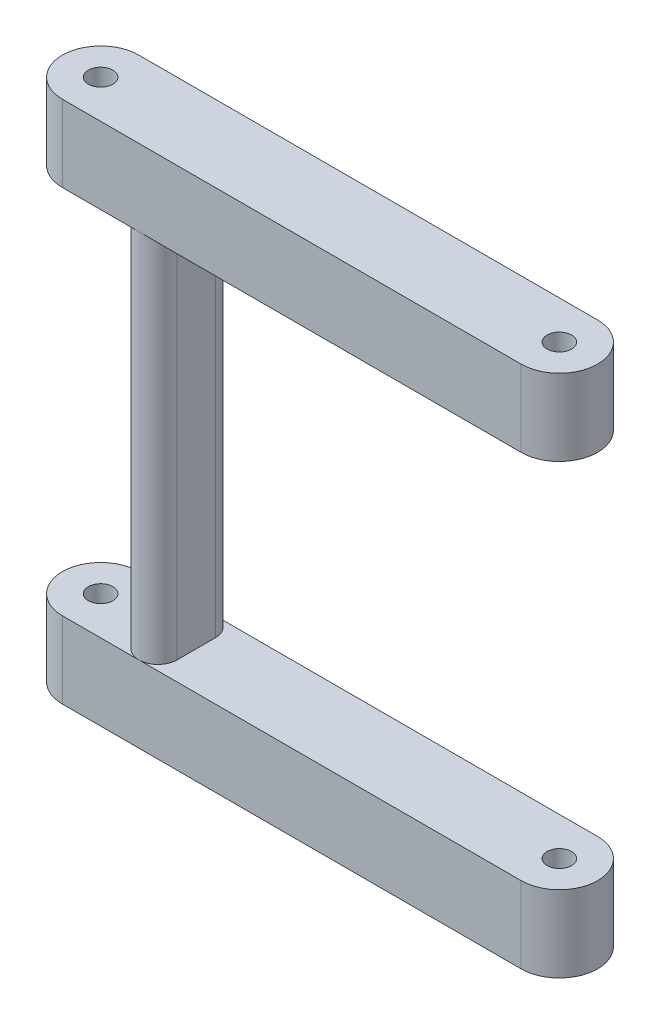
ISO-10303-21;
HEADER;
FILE_DESCRIPTION(('STEP AP214'),'2;1');
FILE_NAME('part.step','',(''),(''),'','','');
FILE_SCHEMA(('AUTOMOTIVE_DESIGN { 1 0 10303 214 1 1 1 1 }'));
ENDSEC;
DATA;
#1=APPLICATION_CONTEXT('core data for automotive mechanical design processes');
#2=APPLICATION_PROTOCOL_DEFINITION('international standard','automotive_design',2000,#1);
#3=PRODUCT_CONTEXT('',#1,'mechanical');
#4=PRODUCT('Part','Part','',(#3));
#5=PRODUCT_RELATED_PRODUCT_CATEGORY('part','',(#4));
#6=PRODUCT_DEFINITION_FORMATION('','',#4);
#7=PRODUCT_DEFINITION_CONTEXT('part definition',#1,'design');
#8=PRODUCT_DEFINITION('design','',#6,#7);
#9=PRODUCT_DEFINITION_SHAPE('','',#8);
#10=(LENGTH_UNIT() NAMED_UNIT(*) SI_UNIT(.MILLI.,.METRE.));
#11=(NAMED_UNIT(*) PLANE_ANGLE_UNIT() SI_UNIT($,.RADIAN.));
#12=(NAMED_UNIT(*) SI_UNIT($,.STERADIAN.) SOLID_ANGLE_UNIT());
#13=UNCERTAINTY_MEASURE_WITH_UNIT(LENGTH_MEASURE(1.E-05),#10,'distance_accuracy_value','');
#14=(GEOMETRIC_REPRESENTATION_CONTEXT(3) GLOBAL_UNCERTAINTY_ASSIGNED_CONTEXT((#13)) GLOBAL_UNIT_ASSIGNED_CONTEXT((#10,
#11,#12)) REPRESENTATION_CONTEXT('',''));
#15=CARTESIAN_POINT('',(0.,0.,0.));
#16=DIRECTION('',(0.,0.,1.));
#17=DIRECTION('',(1.,0.,0.));
#18=AXIS2_PLACEMENT_3D('',#15,#16,#17);
#19=CARTESIAN_POINT('',(78.1647625448029,29.725806451613,-2.5));
#20=DIRECTION('',(0.,1.,0.));
#21=DIRECTION('',(0.,0.,-1.));
#22=AXIS2_PLACEMENT_3D('',#19,#20,#21);
#23=CYLINDRICAL_SURFACE('',#22,2.5);
#24=CARTESIAN_POINT('',(78.1647625448029,29.725806451613,-2.5));
#25=DIRECTION('',(0.,-1.,0.));
#26=DIRECTION('',(0.,0.,-1.));
#27=AXIS2_PLACEMENT_3D('',#24,#25,#26);
#28=CIRCLE('',#27,2.5);
#29=CARTESIAN_POINT('',(75.6647625448029,29.725806451613,-2.5));
#30=VERTEX_POINT('',#29);
#31=CARTESIAN_POINT('',(78.1647625448029,29.725806451613,0.));
#32=VERTEX_POINT('',#31);
#33=EDGE_CURVE('E230',#30,#32,#28,.F.);
#34=ORIENTED_EDGE('',*,*,#33,.T.);
#35=CARTESIAN_POINT('',(78.1647625448029,29.725806451613,-2.5));
#36=DIRECTION('',(0.,-1.,0.));
#37=DIRECTION('',(0.,0.,-1.));
#38=AXIS2_PLACEMENT_3D('',#35,#36,#37);
#39=CIRCLE('',#38,2.5);
#40=CARTESIAN_POINT('',(80.6647625448029,29.725806451613,-2.5));
#41=VERTEX_POINT('',#40);
#42=EDGE_CURVE('E45',#41,#32,#39,.T.);
#43=ORIENTED_EDGE('',*,*,#42,.F.);
#44=DIRECTION('',(0.,1.,0.));
#45=VECTOR('',#44,1.);
#46=CARTESIAN_POINT('',(80.6647625448029,0.,-2.5));
#47=LINE('',#46,#45);
#48=CARTESIAN_POINT('',(80.6647625448029,78.225806451613,-2.5));
#49=VERTEX_POINT('',#48);
#50=EDGE_CURVE('E221',#41,#49,#47,.T.);
#51=ORIENTED_EDGE('',*,*,#50,.T.);
#52=CARTESIAN_POINT('',(78.1647625448029,78.225806451613,-2.5));
#53=DIRECTION('',(0.,1.,0.));
#54=DIRECTION('',(1.,0.,0.));
#55=AXIS2_PLACEMENT_3D('',#52,#53,#54);
#56=CIRCLE('',#55,2.5);
#57=CARTESIAN_POINT('',(78.1647625448029,78.225806451613,0.));
#58=VERTEX_POINT('',#57);
#59=EDGE_CURVE('E227',#49,#58,#56,.F.);
#60=ORIENTED_EDGE('',*,*,#59,.T.);
#61=CARTESIAN_POINT('',(78.1647625448029,78.225806451613,-2.5));
#62=DIRECTION('',(0.,1.,0.));
#63=DIRECTION('',(1.,0.,0.));
#64=AXIS2_PLACEMENT_3D('',#61,#62,#63);
#65=CIRCLE('',#64,2.5);
#66=CARTESIAN_POINT('',(75.6647625448029,78.225806451613,-2.5));
#67=VERTEX_POINT('',#66);
#68=EDGE_CURVE('E11',#67,#58,#65,.T.);
#69=ORIENTED_EDGE('',*,*,#68,.F.);
#70=DIRECTION('',(0.,-1.,0.));
#71=VECTOR('',#70,1.);
#72=CARTESIAN_POINT('',(75.6647625448029,29.725806451613,-2.5));
#73=LINE('',#72,#71);
#74=EDGE_CURVE('E224',#67,#30,#73,.T.);
#75=ORIENTED_EDGE('',*,*,#74,.T.);
#76=EDGE_LOOP('',(#34,#43,#51,#60,#69,#75));
#77=FACE_BOUND('',#76,.T.);
#78=ADVANCED_FACE('F37',(#77),#23,.T.);
#79=CARTESIAN_POINT('',(0.,0.,0.));
#80=DIRECTION('',(0.,0.,-1.));
#81=DIRECTION('',(1.,0.,0.));
#82=AXIS2_PLACEMENT_3D('',#79,#80,#81);
#83=PLANE('',#82);
#84=DIRECTION('',(1.,0.,0.));
#85=VECTOR('',#84,1.);
#86=CARTESIAN_POINT('',(0.,29.725806451613,0.));
#87=LINE('',#86,#85);
#88=CARTESIAN_POINT('',(68.1647625448029,29.725806451613,0.));
#89=VERTEX_POINT('',#88);
#90=EDGE_CURVE('E248',#89,#32,#87,.T.);
#91=ORIENTED_EDGE('',*,*,#90,.F.);
#92=DIRECTION('',(0.,-1.,0.));
#93=VECTOR('',#92,1.);
#94=CARTESIAN_POINT('',(68.164762544803,0.,0.));
#95=LINE('',#94,#93);
#96=CARTESIAN_POINT('',(68.1647625448029,19.725806451613,0.));
#97=VERTEX_POINT('',#96);
#98=EDGE_CURVE('E189',#97,#89,#95,.F.);
#99=ORIENTED_EDGE('',*,*,#98,.F.);
#100=DIRECTION('',(-1.,0.,0.));
#101=VECTOR('',#100,1.);
#102=CARTESIAN_POINT('',(0.,19.725806451613,0.));
#103=LINE('',#102,#101);
#104=CARTESIAN_POINT('',(128.164762544803,19.725806451613,0.));
#105=VERTEX_POINT('',#104);
#106=EDGE_CURVE('E251',#105,#97,#103,.T.);
#107=ORIENTED_EDGE('',*,*,#106,.F.);
#108=DIRECTION('',(0.,1.,0.));
#109=VECTOR('',#108,1.);
#110=CARTESIAN_POINT('',(128.164762544803,19.725806451613,0.));
#111=LINE('',#110,#109);
#112=CARTESIAN_POINT('',(128.164762544803,29.725806451613,0.));
#113=VERTEX_POINT('',#112);
#114=EDGE_CURVE('E199',#113,#105,#111,.F.);
#115=ORIENTED_EDGE('',*,*,#114,.F.);
#116=EDGE_CURVE('E52',#32,#113,#87,.T.);
#117=ORIENTED_EDGE('',*,*,#116,.F.);
#118=EDGE_LOOP('',(#91,#99,#107,#115,#117));
#119=FACE_BOUND('',#118,.T.);
#120=ADVANCED_FACE('F282',(#119),#83,.F.);
#121=CARTESIAN_POINT('',(78.1647625448029,29.725806451613,-7.5));
#122=DIRECTION('',(0.,1.,0.));
#123=DIRECTION('',(0.,0.,-1.));
#124=AXIS2_PLACEMENT_3D('',#121,#122,#123);
#125=CYLINDRICAL_SURFACE('',#124,2.5);
#126=CARTESIAN_POINT('',(78.1647625448029,29.725806451613,-7.5));
#127=DIRECTION('',(0.,-1.,0.));
#128=DIRECTION('',(0.,0.,-1.));
#129=AXIS2_PLACEMENT_3D('',#126,#127,#128);
#130=CIRCLE('',#129,2.5);
#131=CARTESIAN_POINT('',(80.6647625448029,29.725806451613,-7.5));
#132=VERTEX_POINT('',#131);
#133=CARTESIAN_POINT('',(78.1647625448029,29.725806451613,-10.));
#134=VERTEX_POINT('',#133);
#135=EDGE_CURVE('E214',#132,#134,#130,.F.);
#136=ORIENTED_EDGE('',*,*,#135,.T.);
#137=CARTESIAN_POINT('',(78.1647625448029,29.725806451613,-7.5));
#138=DIRECTION('',(0.,-1.,0.));
#139=DIRECTION('',(0.,0.,-1.));
#140=AXIS2_PLACEMENT_3D('',#137,#138,#139);
#141=CIRCLE('',#140,2.5);
#142=CARTESIAN_POINT('',(75.6647625448029,29.725806451613,-7.5));
#143=VERTEX_POINT('',#142);
#144=EDGE_CURVE('E217',#143,#134,#141,.T.);
#145=ORIENTED_EDGE('',*,*,#144,.F.);
#146=DIRECTION('',(0.,1.,0.));
#147=VECTOR('',#146,1.);
#148=CARTESIAN_POINT('',(75.6647625448029,0.,-7.5));
#149=LINE('',#148,#147);
#150=CARTESIAN_POINT('',(75.6647625448029,78.225806451613,-7.5));
#151=VERTEX_POINT('',#150);
#152=EDGE_CURVE('E206',#143,#151,#149,.T.);
#153=ORIENTED_EDGE('',*,*,#152,.T.);
#154=CARTESIAN_POINT('',(78.1647625448029,78.225806451613,-7.5));
#155=DIRECTION('',(0.,1.,0.));
#156=DIRECTION('',(1.,0.,0.));
#157=AXIS2_PLACEMENT_3D('',#154,#155,#156);
#158=CIRCLE('',#157,2.5);
#159=CARTESIAN_POINT('',(78.1647625448029,78.225806451613,-10.));
#160=VERTEX_POINT('',#159);
#161=EDGE_CURVE('E212',#151,#160,#158,.F.);
#162=ORIENTED_EDGE('',*,*,#161,.T.);
#163=CARTESIAN_POINT('',(78.1647625448029,78.225806451613,-7.5));
#164=DIRECTION('',(0.,1.,0.));
#165=DIRECTION('',(1.,0.,0.));
#166=AXIS2_PLACEMENT_3D('',#163,#164,#165);
#167=CIRCLE('',#166,2.5);
#168=CARTESIAN_POINT('',(80.6647625448029,78.225806451613,-7.5));
#169=VERTEX_POINT('',#168);
#170=EDGE_CURVE('E147',#169,#160,#167,.T.);
#171=ORIENTED_EDGE('',*,*,#170,.F.);
#172=DIRECTION('',(0.,-1.,0.));
#173=VECTOR('',#172,1.);
#174=CARTESIAN_POINT('',(80.6647625448029,29.725806451613,-7.5));
#175=LINE('',#174,#173);
#176=EDGE_CURVE('E209',#169,#132,#175,.T.);
#177=ORIENTED_EDGE('',*,*,#176,.T.);
#178=EDGE_LOOP('',(#136,#145,#153,#162,#171,#177));
#179=FACE_BOUND('',#178,.T.);
#180=ADVANCED_FACE('F268',(#179),#125,.T.);
#181=CARTESIAN_POINT('',(0.,0.,-10.));
#182=DIRECTION('',(0.,0.,-1.));
#183=DIRECTION('',(1.,0.,0.));
#184=AXIS2_PLACEMENT_3D('',#181,#182,#183);
#185=PLANE('',#184);
#186=DIRECTION('',(1.,0.,0.));
#187=VECTOR('',#186,1.);
#188=CARTESIAN_POINT('',(0.,29.725806451613,-10.));
#189=LINE('',#188,#187);
#190=CARTESIAN_POINT('',(128.164762544803,29.725806451613,-10.));
#191=VERTEX_POINT('',#190);
#192=EDGE_CURVE('E262',#134,#191,#189,.T.);
#193=ORIENTED_EDGE('',*,*,#192,.T.);
#194=DIRECTION('',(0.,-1.,0.));
#195=VECTOR('',#194,1.);
#196=CARTESIAN_POINT('',(128.164762544803,0.,-10.));
#197=LINE('',#196,#195);
#198=CARTESIAN_POINT('',(128.164762544803,19.725806451613,-10.));
#199=VERTEX_POINT('',#198);
#200=EDGE_CURVE('E196',#199,#191,#197,.F.);
#201=ORIENTED_EDGE('',*,*,#200,.F.);
#202=DIRECTION('',(-1.,0.,0.));
#203=VECTOR('',#202,1.);
#204=CARTESIAN_POINT('',(0.,19.725806451613,-10.));
#205=LINE('',#204,#203);
#206=CARTESIAN_POINT('',(68.1647625448029,19.725806451613,-10.));
#207=VERTEX_POINT('',#206);
#208=EDGE_CURVE('E273',#199,#207,#205,.T.);
#209=ORIENTED_EDGE('',*,*,#208,.T.);
#210=DIRECTION('',(0.,1.,0.));
#211=VECTOR('',#210,1.);
#212=CARTESIAN_POINT('',(68.1647625448029,29.725806451613,-10.));
#213=LINE('',#212,#211);
#214=CARTESIAN_POINT('',(68.1647625448029,29.725806451613,-10.));
#215=VERTEX_POINT('',#214);
#216=EDGE_CURVE('E186',#215,#207,#213,.F.);
#217=ORIENTED_EDGE('',*,*,#216,.F.);
#218=EDGE_CURVE('E269',#215,#134,#189,.T.);
#219=ORIENTED_EDGE('',*,*,#218,.T.);
#220=EDGE_LOOP('',(#193,#201,#209,#217,#219));
#221=FACE_BOUND('',#220,.T.);
#222=ADVANCED_FACE('F276',(#221),#185,.T.);
#223=CARTESIAN_POINT('',(128.164762544803,19.725806451613,-5.));
#224=DIRECTION('',(0.,-1.,0.));
#225=DIRECTION('',(0.,0.,1.));
#226=AXIS2_PLACEMENT_3D('',#223,#224,#225);
#227=CYLINDRICAL_SURFACE('',#226,5.);
#228=ORIENTED_EDGE('',*,*,#200,.T.);
#229=CARTESIAN_POINT('',(128.164762544803,29.725806451613,-5.));
#230=DIRECTION('',(0.,-1.,0.));
#231=DIRECTION('',(0.,0.,-1.));
#232=AXIS2_PLACEMENT_3D('',#229,#230,#231);
#233=CIRCLE('',#232,5.);
#234=EDGE_CURVE('E204',#191,#113,#233,.T.);
#235=ORIENTED_EDGE('',*,*,#234,.T.);
#236=ORIENTED_EDGE('',*,*,#114,.T.);
#237=CARTESIAN_POINT('',(128.164762544803,19.725806451613,-5.));
#238=DIRECTION('',(0.,1.,0.));
#239=DIRECTION('',(0.,0.,1.));
#240=AXIS2_PLACEMENT_3D('',#237,#238,#239);
#241=CIRCLE('',#240,5.);
#242=EDGE_CURVE('E202',#105,#199,#241,.T.);
#243=ORIENTED_EDGE('',*,*,#242,.T.);
#244=EDGE_LOOP('',(#228,#235,#236,#243));
#245=FACE_BOUND('',#244,.T.);
#246=ADVANCED_FACE('F286',(#245),#227,.T.);
#247=CARTESIAN_POINT('',(68.1647625448029,29.725806451613,-5.));
#248=DIRECTION('',(0.,-1.,0.));
#249=DIRECTION('',(1.,0.,0.));
#250=AXIS2_PLACEMENT_3D('',#247,#248,#249);
#251=CYLINDRICAL_SURFACE('',#250,5.);
#252=ORIENTED_EDGE('',*,*,#216,.T.);
#253=CARTESIAN_POINT('',(68.1647625448029,19.725806451613,-5.));
#254=DIRECTION('',(0.,1.,0.));
#255=DIRECTION('',(0.,0.,1.));
#256=AXIS2_PLACEMENT_3D('',#253,#254,#255);
#257=CIRCLE('',#256,5.);
#258=EDGE_CURVE('E194',#207,#97,#257,.T.);
#259=ORIENTED_EDGE('',*,*,#258,.T.);
#260=ORIENTED_EDGE('',*,*,#98,.T.);
#261=CARTESIAN_POINT('',(68.1647625448029,29.725806451613,-5.));
#262=DIRECTION('',(0.,-1.,0.));
#263=DIRECTION('',(0.,0.,-1.));
#264=AXIS2_PLACEMENT_3D('',#261,#262,#263);
#265=CIRCLE('',#264,5.);
#266=EDGE_CURVE('E192',#89,#215,#265,.T.);
#267=ORIENTED_EDGE('',*,*,#266,.T.);
#268=EDGE_LOOP('',(#252,#259,#260,#267));
#269=FACE_BOUND('',#268,.T.);
#270=ADVANCED_FACE('F280',(#269),#251,.T.);
#271=CARTESIAN_POINT('',(68.1647625448029,78.225806451613,-5.));
#272=DIRECTION('',(0.,-1.,0.));
#273=DIRECTION('',(1.,0.,0.));
#274=AXIS2_PLACEMENT_3D('',#271,#272,#273);
#275=CYLINDRICAL_SURFACE('',#274,5.);
#276=DIRECTION('',(0.,-1.,0.));
#277=VECTOR('',#276,1.);
#278=CARTESIAN_POINT('',(68.1647625448028,0.,0.));
#279=LINE('',#278,#277);
#280=CARTESIAN_POINT('',(68.1647625448029,78.225806451613,0.));
#281=VERTEX_POINT('',#280);
#282=CARTESIAN_POINT('',(68.1647625448029,88.225806451613,0.));
#283=VERTEX_POINT('',#282);
#284=EDGE_CURVE('E174',#281,#283,#279,.F.);
#285=ORIENTED_EDGE('',*,*,#284,.T.);
#286=CARTESIAN_POINT('',(68.1647625448029,88.225806451613,-5.));
#287=DIRECTION('',(0.,-1.,0.));
#288=DIRECTION('',(0.,0.,-1.));
#289=AXIS2_PLACEMENT_3D('',#286,#287,#288);
#290=CIRCLE('',#289,5.);
#291=CARTESIAN_POINT('',(68.1647625448029,88.225806451613,-10.));
#292=VERTEX_POINT('',#291);
#293=EDGE_CURVE('E183',#283,#292,#290,.T.);
#294=ORIENTED_EDGE('',*,*,#293,.T.);
#295=DIRECTION('',(0.,1.,0.));
#296=VECTOR('',#295,1.);
#297=CARTESIAN_POINT('',(68.1647625448029,78.225806451613,-10.));
#298=LINE('',#297,#296);
#299=CARTESIAN_POINT('',(68.1647625448029,78.225806451613,-10.));
#300=VERTEX_POINT('',#299);
#301=EDGE_CURVE('E177',#292,#300,#298,.F.);
#302=ORIENTED_EDGE('',*,*,#301,.T.);
#303=CARTESIAN_POINT('',(68.1647625448029,78.225806451613,-5.));
#304=DIRECTION('',(0.,1.,0.));
#305=DIRECTION('',(1.,0.,0.));
#306=AXIS2_PLACEMENT_3D('',#303,#304,#305);
#307=CIRCLE('',#306,5.);
#308=EDGE_CURVE('E180',#300,#281,#307,.T.);
#309=ORIENTED_EDGE('',*,*,#308,.T.);
#310=EDGE_LOOP('',(#285,#294,#302,#309));
#311=FACE_BOUND('',#310,.T.);
#312=ADVANCED_FACE('F364',(#311),#275,.T.);
#313=CARTESIAN_POINT('',(128.164762544803,78.225806451613,-5.));
#314=DIRECTION('',(0.,-1.,0.));
#315=DIRECTION('',(1.,0.,0.));
#316=AXIS2_PLACEMENT_3D('',#313,#314,#315);
#317=CYLINDRICAL_SURFACE('',#316,5.);
#318=DIRECTION('',(0.,-1.,0.));
#319=VECTOR('',#318,1.);
#320=CARTESIAN_POINT('',(128.164762544803,3.55728675807142E-13,-10.));
#321=LINE('',#320,#319);
#322=CARTESIAN_POINT('',(128.164762544803,78.225806451613,-10.));
#323=VERTEX_POINT('',#322);
#324=CARTESIAN_POINT('',(128.164762544803,88.225806451613,-10.));
#325=VERTEX_POINT('',#324);
#326=EDGE_CURVE('E158',#323,#325,#321,.F.);
#327=ORIENTED_EDGE('',*,*,#326,.T.);
#328=CARTESIAN_POINT('',(128.164762544803,88.225806451613,-5.));
#329=DIRECTION('',(0.,-1.,0.));
#330=DIRECTION('',(0.,0.,-1.));
#331=AXIS2_PLACEMENT_3D('',#328,#329,#330);
#332=CIRCLE('',#331,5.);
#333=CARTESIAN_POINT('',(128.164762544803,88.225806451613,0.));
#334=VERTEX_POINT('',#333);
#335=EDGE_CURVE('E161',#325,#334,#332,.T.);
#336=ORIENTED_EDGE('',*,*,#335,.T.);
#337=DIRECTION('',(0.,1.,0.));
#338=VECTOR('',#337,1.);
#339=CARTESIAN_POINT('',(128.164762544803,78.225806451613,0.));
#340=LINE('',#339,#338);
#341=CARTESIAN_POINT('',(128.164762544803,78.225806451613,0.));
#342=VERTEX_POINT('',#341);
#343=EDGE_CURVE('E160',#334,#342,#340,.F.);
#344=ORIENTED_EDGE('',*,*,#343,.T.);
#345=CARTESIAN_POINT('',(128.164762544803,78.225806451613,-5.));
#346=DIRECTION('',(0.,1.,0.));
#347=DIRECTION('',(1.,0.,0.));
#348=AXIS2_PLACEMENT_3D('',#345,#346,#347);
#349=CIRCLE('',#348,5.);
#350=EDGE_CURVE('E144',#342,#323,#349,.T.);
#351=ORIENTED_EDGE('',*,*,#350,.T.);
#352=EDGE_LOOP('',(#327,#336,#344,#351));
#353=FACE_BOUND('',#352,.T.);
#354=ADVANCED_FACE('F156',(#353),#317,.T.);
#355=CARTESIAN_POINT('',(0.,78.2258064516129,-10.));
#356=DIRECTION('',(0.,-1.,0.));
#357=DIRECTION('',(1.,0.,0.));
#358=AXIS2_PLACEMENT_3D('',#355,#356,#357);
#359=PLANE('',#358);
#360=CARTESIAN_POINT('',(128.164762544803,78.225806451613,-5.));
#361=DIRECTION('',(0.,1.,0.));
#362=DIRECTION('',(1.,0.,0.));
#363=AXIS2_PLACEMENT_3D('',#360,#361,#362);
#364=CIRCLE('',#363,1.60000000000002);
#365=CARTESIAN_POINT('',(129.764762544803,78.225806451613,-5.));
#366=VERTEX_POINT('',#365);
#367=EDGE_CURVE('E297',#366,#366,#364,.T.);
#368=ORIENTED_EDGE('',*,*,#367,.T.);
#369=EDGE_LOOP('',(#368));
#370=FACE_BOUND('',#369,.T.);
#371=DIRECTION('',(-1.,0.,0.));
#372=VECTOR('',#371,1.);
#373=CARTESIAN_POINT('',(0.,78.2258064516129,0.));
#374=LINE('',#373,#372);
#375=EDGE_CURVE('E257',#342,#58,#374,.T.);
#376=ORIENTED_EDGE('',*,*,#375,.T.);
#377=ORIENTED_EDGE('',*,*,#59,.F.);
#378=DIRECTION('',(0.,0.,1.));
#379=VECTOR('',#378,1.);
#380=CARTESIAN_POINT('',(80.6647625448029,78.225806451613,-10.));
#381=LINE('',#380,#379);
#382=EDGE_CURVE('E260',#169,#49,#381,.T.);
#383=ORIENTED_EDGE('',*,*,#382,.F.);
#384=ORIENTED_EDGE('',*,*,#170,.T.);
#385=DIRECTION('',(-1.,0.,0.));
#386=VECTOR('',#385,1.);
#387=CARTESIAN_POINT('',(0.,78.2258064516129,-10.));
#388=LINE('',#387,#386);
#389=EDGE_CURVE('E141',#323,#160,#388,.T.);
#390=ORIENTED_EDGE('',*,*,#389,.F.);
#391=ORIENTED_EDGE('',*,*,#350,.F.);
#392=EDGE_LOOP('',(#376,#377,#383,#384,#390,#391));
#393=FACE_BOUND('',#392,.T.);
#394=ADVANCED_FACE('F143',(#370,#393),#359,.T.);
#395=CARTESIAN_POINT('',(0.,88.225806451613,-10.));
#396=DIRECTION('',(0.,1.,0.));
#397=DIRECTION('',(0.,0.,-1.));
#398=AXIS2_PLACEMENT_3D('',#395,#396,#397);
#399=PLANE('',#398);
#400=CARTESIAN_POINT('',(128.164762544803,88.225806451613,-5.));
#401=DIRECTION('',(0.,-1.,0.));
#402=DIRECTION('',(0.,0.,-1.));
#403=AXIS2_PLACEMENT_3D('',#400,#401,#402);
#404=CIRCLE('',#403,1.60000000000002);
#405=CARTESIAN_POINT('',(128.164762544803,88.225806451613,-6.60000000000002));
#406=VERTEX_POINT('',#405);
#407=EDGE_CURVE('E308',#406,#406,#404,.T.);
#408=ORIENTED_EDGE('',*,*,#407,.T.);
#409=EDGE_LOOP('',(#408));
#410=FACE_BOUND('',#409,.T.);
#411=CARTESIAN_POINT('',(68.1647625448029,88.225806451613,-5.));
#412=DIRECTION('',(0.,-1.,0.));
#413=DIRECTION('',(0.,0.,-1.));
#414=AXIS2_PLACEMENT_3D('',#411,#412,#413);
#415=CIRCLE('',#414,1.60000000000001);
#416=CARTESIAN_POINT('',(68.1647625448029,88.225806451613,-6.6));
#417=VERTEX_POINT('',#416);
#418=EDGE_CURVE('E302',#417,#417,#415,.T.);
#419=ORIENTED_EDGE('',*,*,#418,.T.);
#420=EDGE_LOOP('',(#419));
#421=FACE_BOUND('',#420,.T.);
#422=DIRECTION('',(1.,0.,0.));
#423=VECTOR('',#422,1.);
#424=CARTESIAN_POINT('',(0.,88.225806451613,0.));
#425=LINE('',#424,#423);
#426=EDGE_CURVE('E255',#283,#334,#425,.T.);
#427=ORIENTED_EDGE('',*,*,#426,.T.);
#428=ORIENTED_EDGE('',*,*,#335,.F.);
#429=DIRECTION('',(1.,0.,0.));
#430=VECTOR('',#429,1.);
#431=CARTESIAN_POINT('',(0.,88.225806451613,-10.));
#432=LINE('',#431,#430);
#433=EDGE_CURVE('E151',#292,#325,#432,.T.);
#434=ORIENTED_EDGE('',*,*,#433,.F.);
#435=ORIENTED_EDGE('',*,*,#293,.F.);
#436=EDGE_LOOP('',(#427,#428,#434,#435));
#437=FACE_BOUND('',#436,.T.);
#438=ADVANCED_FACE('F358',(#410,#421,#437),#399,.T.);
#439=CARTESIAN_POINT('',(68.1647625448029,78.225806451613,-5.));
#440=DIRECTION('',(0.,1.,0.));
#441=DIRECTION('',(1.,0.,0.));
#442=AXIS2_PLACEMENT_3D('',#439,#440,#441);
#443=CIRCLE('',#442,1.60000000000001);
#444=CARTESIAN_POINT('',(69.7647625448029,78.225806451613,-5.));
#445=VERTEX_POINT('',#444);
#446=EDGE_CURVE('E289',#445,#445,#443,.T.);
#447=ORIENTED_EDGE('',*,*,#446,.T.);
#448=EDGE_LOOP('',(#447));
#449=FACE_BOUND('',#448,.T.);
#450=EDGE_CURVE('E153',#160,#300,#388,.T.);
#451=ORIENTED_EDGE('',*,*,#450,.F.);
#452=ORIENTED_EDGE('',*,*,#161,.F.);
#453=DIRECTION('',(0.,0.,1.));
#454=VECTOR('',#453,1.);
#455=CARTESIAN_POINT('',(75.6647625448029,78.225806451613,-10.));
#456=LINE('',#455,#454);
#457=EDGE_CURVE('E166',#151,#67,#456,.T.);
#458=ORIENTED_EDGE('',*,*,#457,.T.);
#459=ORIENTED_EDGE('',*,*,#68,.T.);
#460=EDGE_CURVE('E60',#58,#281,#374,.T.);
#461=ORIENTED_EDGE('',*,*,#460,.T.);
#462=ORIENTED_EDGE('',*,*,#308,.F.);
#463=EDGE_LOOP('',(#451,#452,#458,#459,#461,#462));
#464=FACE_BOUND('',#463,.T.);
#465=ADVANCED_FACE('F355',(#449,#464),#359,.T.);
#466=CARTESIAN_POINT('',(75.6647625448029,0.,-10.));
#467=DIRECTION('',(-1.,0.,0.));
#468=DIRECTION('',(0.,0.,-1.));
#469=AXIS2_PLACEMENT_3D('',#466,#467,#468);
#470=PLANE('',#469);
#471=ORIENTED_EDGE('',*,*,#457,.F.);
#472=ORIENTED_EDGE('',*,*,#152,.F.);
#473=DIRECTION('',(0.,0.,1.));
#474=VECTOR('',#473,1.);
#475=CARTESIAN_POINT('',(75.6647625448029,29.725806451613,-10.));
#476=LINE('',#475,#474);
#477=EDGE_CURVE('E169',#143,#30,#476,.T.);
#478=ORIENTED_EDGE('',*,*,#477,.T.);
#479=ORIENTED_EDGE('',*,*,#74,.F.);
#480=EDGE_LOOP('',(#471,#472,#478,#479));
#481=FACE_BOUND('',#480,.T.);
#482=ADVANCED_FACE('F264',(#481),#470,.T.);
#483=CARTESIAN_POINT('',(0.,29.725806451613,-10.));
#484=DIRECTION('',(0.,1.,0.));
#485=DIRECTION('',(0.,0.,-1.));
#486=AXIS2_PLACEMENT_3D('',#483,#484,#485);
#487=PLANE('',#486);
#488=CARTESIAN_POINT('',(68.1647625448029,29.725806451613,-5.));
#489=DIRECTION('',(0.,-1.,0.));
#490=DIRECTION('',(0.,0.,-1.));
#491=AXIS2_PLACEMENT_3D('',#488,#489,#490);
#492=CIRCLE('',#491,1.60000000000001);
#493=CARTESIAN_POINT('',(68.1647625448029,29.725806451613,-6.6));
#494=VERTEX_POINT('',#493);
#495=EDGE_CURVE('E292',#494,#494,#492,.T.);
#496=ORIENTED_EDGE('',*,*,#495,.T.);
#497=EDGE_LOOP('',(#496));
#498=FACE_BOUND('',#497,.T.);
#499=ORIENTED_EDGE('',*,*,#90,.T.);
#500=ORIENTED_EDGE('',*,*,#33,.F.);
#501=ORIENTED_EDGE('',*,*,#477,.F.);
#502=ORIENTED_EDGE('',*,*,#144,.T.);
#503=ORIENTED_EDGE('',*,*,#218,.F.);
#504=ORIENTED_EDGE('',*,*,#266,.F.);
#505=EDGE_LOOP('',(#499,#500,#501,#502,#503,#504));
#506=FACE_BOUND('',#505,.T.);
#507=ADVANCED_FACE('F246',(#498,#506),#487,.T.);
#508=CARTESIAN_POINT('',(0.,19.725806451613,-10.));
#509=DIRECTION('',(0.,-1.,0.));
#510=DIRECTION('',(0.,0.,1.));
#511=AXIS2_PLACEMENT_3D('',#508,#509,#510);
#512=PLANE('',#511);
#513=CARTESIAN_POINT('',(128.164762544803,19.725806451613,-5.));
#514=DIRECTION('',(0.,-1.,0.));
#515=DIRECTION('',(0.,0.,-1.));
#516=AXIS2_PLACEMENT_3D('',#513,#514,#515);
#517=CIRCLE('',#516,1.60000000000002);
#518=CARTESIAN_POINT('',(128.164762544803,19.725806451613,-6.60000000000002));
#519=VERTEX_POINT('',#518);
#520=EDGE_CURVE('E311',#519,#519,#517,.T.);
#521=ORIENTED_EDGE('',*,*,#520,.F.);
#522=EDGE_LOOP('',(#521));
#523=FACE_BOUND('',#522,.T.);
#524=CARTESIAN_POINT('',(68.1647625448029,19.725806451613,-5.));
#525=DIRECTION('',(0.,-1.,0.));
#526=DIRECTION('',(0.,0.,-1.));
#527=AXIS2_PLACEMENT_3D('',#524,#525,#526);
#528=CIRCLE('',#527,1.60000000000001);
#529=CARTESIAN_POINT('',(68.1647625448029,19.725806451613,-6.6));
#530=VERTEX_POINT('',#529);
#531=EDGE_CURVE('E305',#530,#530,#528,.T.);
#532=ORIENTED_EDGE('',*,*,#531,.F.);
#533=EDGE_LOOP('',(#532));
#534=FACE_BOUND('',#533,.T.);
#535=ORIENTED_EDGE('',*,*,#106,.T.);
#536=ORIENTED_EDGE('',*,*,#258,.F.);
#537=ORIENTED_EDGE('',*,*,#208,.F.);
#538=ORIENTED_EDGE('',*,*,#242,.F.);
#539=EDGE_LOOP('',(#535,#536,#537,#538));
#540=FACE_BOUND('',#539,.T.);
#541=ADVANCED_FACE('F284',(#523,#534,#540),#512,.T.);
#542=CARTESIAN_POINT('',(128.164762544803,29.725806451613,-5.));
#543=DIRECTION('',(0.,-1.,0.));
#544=DIRECTION('',(0.,0.,-1.));
#545=AXIS2_PLACEMENT_3D('',#542,#543,#544);
#546=CIRCLE('',#545,1.60000000000002);
#547=CARTESIAN_POINT('',(128.164762544803,29.725806451613,-6.60000000000002));
#548=VERTEX_POINT('',#547);
#549=EDGE_CURVE('E40',#548,#548,#546,.T.);
#550=ORIENTED_EDGE('',*,*,#549,.T.);
#551=EDGE_LOOP('',(#550));
#552=FACE_BOUND('',#551,.T.);
#553=ORIENTED_EDGE('',*,*,#192,.F.);
#554=ORIENTED_EDGE('',*,*,#135,.F.);
#555=DIRECTION('',(0.,0.,1.));
#556=VECTOR('',#555,1.);
#557=CARTESIAN_POINT('',(80.6647625448029,29.725806451613,-10.));
#558=LINE('',#557,#556);
#559=EDGE_CURVE('E239',#132,#41,#558,.T.);
#560=ORIENTED_EDGE('',*,*,#559,.T.);
#561=ORIENTED_EDGE('',*,*,#42,.T.);
#562=ORIENTED_EDGE('',*,*,#116,.T.);
#563=ORIENTED_EDGE('',*,*,#234,.F.);
#564=EDGE_LOOP('',(#553,#554,#560,#561,#562,#563));
#565=FACE_BOUND('',#564,.T.);
#566=ADVANCED_FACE('F237',(#552,#565),#487,.T.);
#567=CARTESIAN_POINT('',(80.6647625448029,0.,-10.));
#568=DIRECTION('',(-1.,0.,0.));
#569=DIRECTION('',(0.,0.,-1.));
#570=AXIS2_PLACEMENT_3D('',#567,#568,#569);
#571=PLANE('',#570);
#572=ORIENTED_EDGE('',*,*,#559,.F.);
#573=ORIENTED_EDGE('',*,*,#176,.F.);
#574=ORIENTED_EDGE('',*,*,#382,.T.);
#575=ORIENTED_EDGE('',*,*,#50,.F.);
#576=EDGE_LOOP('',(#572,#573,#574,#575));
#577=FACE_BOUND('',#576,.T.);
#578=ADVANCED_FACE('F344',(#577),#571,.F.);
#579=ORIENTED_EDGE('',*,*,#450,.T.);
#580=ORIENTED_EDGE('',*,*,#301,.F.);
#581=ORIENTED_EDGE('',*,*,#433,.T.);
#582=ORIENTED_EDGE('',*,*,#326,.F.);
#583=ORIENTED_EDGE('',*,*,#389,.T.);
#584=EDGE_LOOP('',(#579,#580,#581,#582,#583));
#585=FACE_BOUND('',#584,.T.);
#586=ADVANCED_FACE('F163',(#585),#185,.T.);
#587=ORIENTED_EDGE('',*,*,#375,.F.);
#588=ORIENTED_EDGE('',*,*,#343,.F.);
#589=ORIENTED_EDGE('',*,*,#426,.F.);
#590=ORIENTED_EDGE('',*,*,#284,.F.);
#591=ORIENTED_EDGE('',*,*,#460,.F.);
#592=EDGE_LOOP('',(#587,#588,#589,#590,#591));
#593=FACE_BOUND('',#592,.T.);
#594=ADVANCED_FACE('F322',(#593),#83,.F.);
#595=CARTESIAN_POINT('',(128.164762544803,19.725806451613,-5.));
#596=DIRECTION('',(0.,1.,0.));
#597=DIRECTION('',(0.,0.,-1.));
#598=AXIS2_PLACEMENT_3D('',#595,#596,#597);
#599=CYLINDRICAL_SURFACE('',#598,1.60000000000002);
#600=ORIENTED_EDGE('',*,*,#549,.F.);
#601=EDGE_LOOP('',(#600));
#602=FACE_BOUND('',#601,.T.);
#603=ORIENTED_EDGE('',*,*,#520,.T.);
#604=EDGE_LOOP('',(#603));
#605=FACE_BOUND('',#604,.T.);
#606=ADVANCED_FACE('F319',(#602,#605),#599,.F.);
#607=CARTESIAN_POINT('',(68.1647625448029,19.725806451613,-5.));
#608=DIRECTION('',(0.,1.,0.));
#609=DIRECTION('',(0.,0.,-1.));
#610=AXIS2_PLACEMENT_3D('',#607,#608,#609);
#611=CYLINDRICAL_SURFACE('',#610,1.60000000000001);
#612=ORIENTED_EDGE('',*,*,#495,.F.);
#613=EDGE_LOOP('',(#612));
#614=FACE_BOUND('',#613,.T.);
#615=ORIENTED_EDGE('',*,*,#531,.T.);
#616=EDGE_LOOP('',(#615));
#617=FACE_BOUND('',#616,.T.);
#618=ADVANCED_FACE('F321',(#614,#617),#611,.F.);
#619=ORIENTED_EDGE('',*,*,#446,.F.);
#620=EDGE_LOOP('',(#619));
#621=FACE_BOUND('',#620,.T.);
#622=ORIENTED_EDGE('',*,*,#418,.F.);
#623=EDGE_LOOP('',(#622));
#624=FACE_BOUND('',#623,.T.);
#625=ADVANCED_FACE('F329',(#621,#624),#611,.F.);
#626=ORIENTED_EDGE('',*,*,#367,.F.);
#627=EDGE_LOOP('',(#626));
#628=FACE_BOUND('',#627,.T.);
#629=ORIENTED_EDGE('',*,*,#407,.F.);
#630=EDGE_LOOP('',(#629));
#631=FACE_BOUND('',#630,.T.);
#632=ADVANCED_FACE('F324',(#628,#631),#599,.F.);
#633=CLOSED_SHELL('',(#78,#120,#180,#222,#246,#270,#312,#354,#394,#438,#465,#482,#507,#541,#566,
#578,#586,#594,#606,#618,#625,#632));
#634=MANIFOLD_SOLID_BREP('B2',#633);
#635=ADVANCED_BREP_SHAPE_REPRESENTATION('',(#18,#634),#14);
#636=SHAPE_DEFINITION_REPRESENTATION(#9,#635);
ENDSEC;
END-ISO-10303-21;
